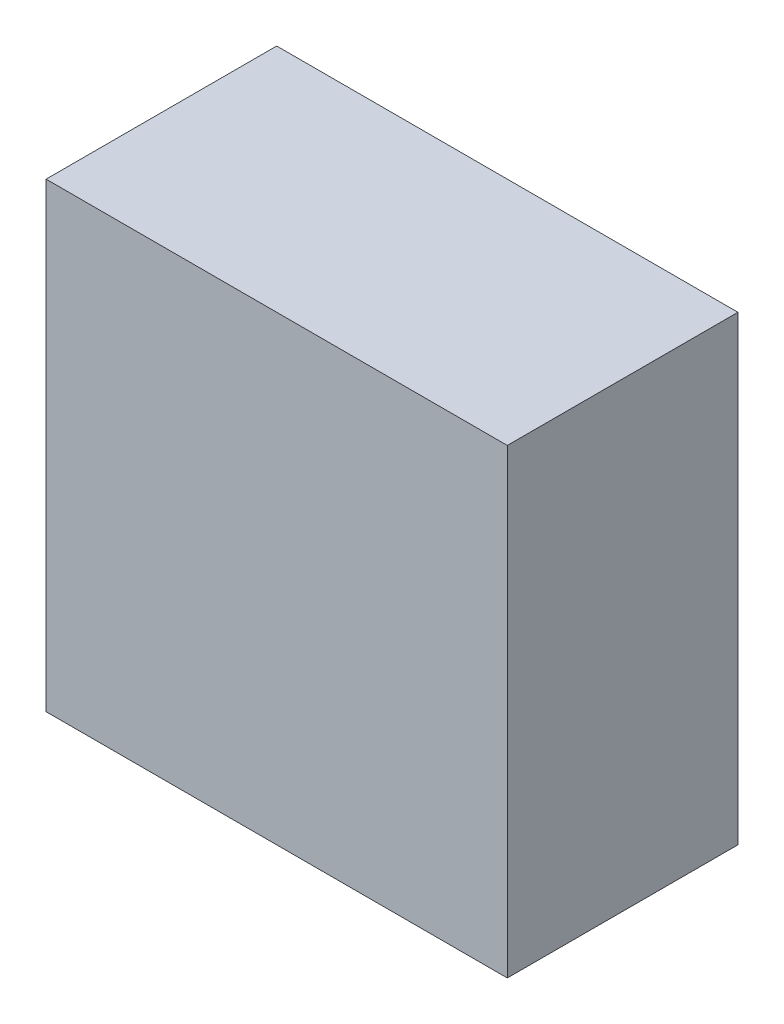
ISO-10303-21;
HEADER;
FILE_DESCRIPTION(('STEP AP214'),'2;1');
FILE_NAME('part.step','',(''),(''),'','','');
FILE_SCHEMA(('AUTOMOTIVE_DESIGN { 1 0 10303 214 1 1 1 1 }'));
ENDSEC;
DATA;
#1=APPLICATION_CONTEXT('core data for automotive mechanical design processes');
#2=APPLICATION_PROTOCOL_DEFINITION('international standard','automotive_design',2000,#1);
#3=PRODUCT_CONTEXT('',#1,'mechanical');
#4=PRODUCT('Part','Part','',(#3));
#5=PRODUCT_RELATED_PRODUCT_CATEGORY('part','',(#4));
#6=PRODUCT_DEFINITION_FORMATION('','',#4);
#7=PRODUCT_DEFINITION_CONTEXT('part definition',#1,'design');
#8=PRODUCT_DEFINITION('design','',#6,#7);
#9=PRODUCT_DEFINITION_SHAPE('','',#8);
#10=(LENGTH_UNIT() NAMED_UNIT(*) SI_UNIT(.MILLI.,.METRE.));
#11=(NAMED_UNIT(*) PLANE_ANGLE_UNIT() SI_UNIT($,.RADIAN.));
#12=(NAMED_UNIT(*) SI_UNIT($,.STERADIAN.) SOLID_ANGLE_UNIT());
#13=UNCERTAINTY_MEASURE_WITH_UNIT(LENGTH_MEASURE(1.E-05),#10,'distance_accuracy_value','');
#14=(GEOMETRIC_REPRESENTATION_CONTEXT(3) GLOBAL_UNCERTAINTY_ASSIGNED_CONTEXT((#13)) GLOBAL_UNIT_ASSIGNED_CONTEXT((#10,
#11,#12)) REPRESENTATION_CONTEXT('',''));
#15=CARTESIAN_POINT('',(0.,0.,0.));
#16=DIRECTION('',(0.,0.,1.));
#17=DIRECTION('',(1.,0.,0.));
#18=AXIS2_PLACEMENT_3D('',#15,#16,#17);
#19=CARTESIAN_POINT('',(0.,0.,2.75));
#20=DIRECTION('',(0.,0.,-1.));
#21=DIRECTION('',(-1.,0.,0.));
#22=AXIS2_PLACEMENT_3D('',#19,#20,#21);
#23=PLANE('',#22);
#24=DIRECTION('',(1.,0.,0.));
#25=VECTOR('',#24,1.);
#26=CARTESIAN_POINT('',(142.,165.941489418563,2.75));
#27=LINE('',#26,#25);
#28=CARTESIAN_POINT('',(138.,165.941489418563,2.75));
#29=VERTEX_POINT('',#28);
#30=CARTESIAN_POINT('',(142.,165.941489418563,2.75));
#31=VERTEX_POINT('',#30);
#32=EDGE_CURVE('E80',#29,#31,#27,.T.);
#33=ORIENTED_EDGE('',*,*,#32,.T.);
#34=DIRECTION('',(0.,1.,0.));
#35=VECTOR('',#34,1.);
#36=CARTESIAN_POINT('',(142.,169.941489418563,2.75));
#37=LINE('',#36,#35);
#38=CARTESIAN_POINT('',(142.,169.941489418563,2.75));
#39=VERTEX_POINT('',#38);
#40=EDGE_CURVE('E55',#31,#39,#37,.T.);
#41=ORIENTED_EDGE('',*,*,#40,.T.);
#42=DIRECTION('',(1.,0.,0.));
#43=VECTOR('',#42,1.);
#44=CARTESIAN_POINT('',(142.,169.941489418563,2.75));
#45=LINE('',#44,#43);
#46=CARTESIAN_POINT('',(138.,169.941489418563,2.75));
#47=VERTEX_POINT('',#46);
#48=EDGE_CURVE('E57',#39,#47,#45,.F.);
#49=ORIENTED_EDGE('',*,*,#48,.T.);
#50=DIRECTION('',(0.,1.,0.));
#51=VECTOR('',#50,1.);
#52=CARTESIAN_POINT('',(138.,169.941489418563,2.75));
#53=LINE('',#52,#51);
#54=EDGE_CURVE('E20',#47,#29,#53,.F.);
#55=ORIENTED_EDGE('',*,*,#54,.T.);
#56=EDGE_LOOP('',(#33,#41,#49,#55));
#57=FACE_BOUND('',#56,.T.);
#58=ADVANCED_FACE('F17',(#57),#23,.F.);
#59=CARTESIAN_POINT('',(138.,169.941489418563,2.75));
#60=DIRECTION('',(1.,0.,0.));
#61=DIRECTION('',(0.,0.,-1.));
#62=AXIS2_PLACEMENT_3D('',#59,#60,#61);
#63=PLANE('',#62);
#64=DIRECTION('',(0.,0.,1.));
#65=VECTOR('',#64,1.);
#66=CARTESIAN_POINT('',(138.,165.941489418563,2.75));
#67=LINE('',#66,#65);
#68=CARTESIAN_POINT('',(138.,165.941489418563,0.75));
#69=VERTEX_POINT('',#68);
#70=EDGE_CURVE('E68',#69,#29,#67,.T.);
#71=ORIENTED_EDGE('',*,*,#70,.T.);
#72=ORIENTED_EDGE('',*,*,#54,.F.);
#73=DIRECTION('',(0.,0.,-1.));
#74=VECTOR('',#73,1.);
#75=CARTESIAN_POINT('',(138.,169.941489418563,2.75));
#76=LINE('',#75,#74);
#77=CARTESIAN_POINT('',(138.,169.941489418563,0.75));
#78=VERTEX_POINT('',#77);
#79=EDGE_CURVE('E63',#47,#78,#76,.T.);
#80=ORIENTED_EDGE('',*,*,#79,.T.);
#81=DIRECTION('',(0.,1.,0.));
#82=VECTOR('',#81,1.);
#83=CARTESIAN_POINT('',(138.,0.,0.75));
#84=LINE('',#83,#82);
#85=EDGE_CURVE('E83',#69,#78,#84,.T.);
#86=ORIENTED_EDGE('',*,*,#85,.F.);
#87=EDGE_LOOP('',(#71,#72,#80,#86));
#88=FACE_BOUND('',#87,.T.);
#89=ADVANCED_FACE('F65',(#88),#63,.F.);
#90=CARTESIAN_POINT('',(142.,169.941489418563,2.75));
#91=DIRECTION('',(0.,-1.,0.));
#92=DIRECTION('',(0.,0.,-1.));
#93=AXIS2_PLACEMENT_3D('',#90,#91,#92);
#94=PLANE('',#93);
#95=ORIENTED_EDGE('',*,*,#79,.F.);
#96=ORIENTED_EDGE('',*,*,#48,.F.);
#97=DIRECTION('',(0.,0.,1.));
#98=VECTOR('',#97,1.);
#99=CARTESIAN_POINT('',(142.,169.941489418563,2.75));
#100=LINE('',#99,#98);
#101=CARTESIAN_POINT('',(142.,169.941489418563,0.75));
#102=VERTEX_POINT('',#101);
#103=EDGE_CURVE('E75',#39,#102,#100,.F.);
#104=ORIENTED_EDGE('',*,*,#103,.T.);
#105=DIRECTION('',(-1.,0.,0.));
#106=VECTOR('',#105,1.);
#107=CARTESIAN_POINT('',(0.,169.941489418563,0.75));
#108=LINE('',#107,#106);
#109=EDGE_CURVE('E72',#78,#102,#108,.F.);
#110=ORIENTED_EDGE('',*,*,#109,.F.);
#111=EDGE_LOOP('',(#95,#96,#104,#110));
#112=FACE_BOUND('',#111,.T.);
#113=ADVANCED_FACE('F70',(#112),#94,.F.);
#114=CARTESIAN_POINT('',(142.,169.941489418563,2.75));
#115=DIRECTION('',(-1.,0.,0.));
#116=DIRECTION('',(0.,0.,1.));
#117=AXIS2_PLACEMENT_3D('',#114,#115,#116);
#118=PLANE('',#117);
#119=ORIENTED_EDGE('',*,*,#103,.F.);
#120=ORIENTED_EDGE('',*,*,#40,.F.);
#121=DIRECTION('',(0.,0.,1.));
#122=VECTOR('',#121,1.);
#123=CARTESIAN_POINT('',(142.,165.941489418563,2.75));
#124=LINE('',#123,#122);
#125=CARTESIAN_POINT('',(142.,165.941489418563,0.75));
#126=VERTEX_POINT('',#125);
#127=EDGE_CURVE('E35',#31,#126,#124,.F.);
#128=ORIENTED_EDGE('',*,*,#127,.T.);
#129=DIRECTION('',(0.,1.,0.));
#130=VECTOR('',#129,1.);
#131=CARTESIAN_POINT('',(142.,0.,0.75));
#132=LINE('',#131,#130);
#133=EDGE_CURVE('E26',#102,#126,#132,.F.);
#134=ORIENTED_EDGE('',*,*,#133,.F.);
#135=EDGE_LOOP('',(#119,#120,#128,#134));
#136=FACE_BOUND('',#135,.T.);
#137=ADVANCED_FACE('F89',(#136),#118,.F.);
#138=CARTESIAN_POINT('',(142.,165.941489418563,2.75));
#139=DIRECTION('',(0.,1.,0.));
#140=DIRECTION('',(0.,0.,1.));
#141=AXIS2_PLACEMENT_3D('',#138,#139,#140);
#142=PLANE('',#141);
#143=ORIENTED_EDGE('',*,*,#127,.F.);
#144=ORIENTED_EDGE('',*,*,#32,.F.);
#145=ORIENTED_EDGE('',*,*,#70,.F.);
#146=DIRECTION('',(-1.,0.,0.));
#147=VECTOR('',#146,1.);
#148=CARTESIAN_POINT('',(0.,165.941489418563,0.75));
#149=LINE('',#148,#147);
#150=EDGE_CURVE('E11',#126,#69,#149,.T.);
#151=ORIENTED_EDGE('',*,*,#150,.F.);
#152=EDGE_LOOP('',(#143,#144,#145,#151));
#153=FACE_BOUND('',#152,.T.);
#154=ADVANCED_FACE('F91',(#153),#142,.F.);
#155=CARTESIAN_POINT('',(0.,0.,0.75));
#156=DIRECTION('',(0.,0.,-1.));
#157=DIRECTION('',(-1.,0.,0.));
#158=AXIS2_PLACEMENT_3D('',#155,#156,#157);
#159=PLANE('',#158);
#160=ORIENTED_EDGE('',*,*,#133,.T.);
#161=ORIENTED_EDGE('',*,*,#150,.T.);
#162=ORIENTED_EDGE('',*,*,#85,.T.);
#163=ORIENTED_EDGE('',*,*,#109,.T.);
#164=EDGE_LOOP('',(#160,#161,#162,#163));
#165=FACE_BOUND('',#164,.T.);
#166=ADVANCED_FACE('F88',(#165),#159,.T.);
#167=CLOSED_SHELL('',(#58,#89,#113,#137,#154,#166));
#168=MANIFOLD_SOLID_BREP('B1',#167);
#169=ADVANCED_BREP_SHAPE_REPRESENTATION('',(#18,#168),#14);
#170=SHAPE_DEFINITION_REPRESENTATION(#9,#169);
ENDSEC;
END-ISO-10303-21;
